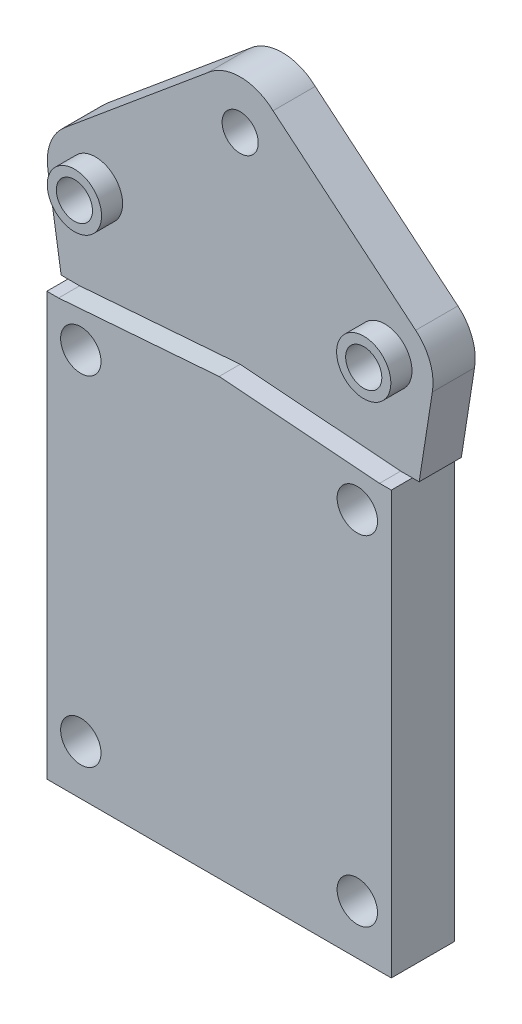
ISO-10303-21;
HEADER;
FILE_DESCRIPTION(('STEP AP214'),'2;1');
FILE_NAME('part.step','',(''),(''),'','','');
FILE_SCHEMA(('AUTOMOTIVE_DESIGN { 1 0 10303 214 1 1 1 1 }'));
ENDSEC;
DATA;
#1=APPLICATION_CONTEXT('core data for automotive mechanical design processes');
#2=APPLICATION_PROTOCOL_DEFINITION('international standard','automotive_design',2000,#1);
#3=PRODUCT_CONTEXT('',#1,'mechanical');
#4=PRODUCT('Part','Part','',(#3));
#5=PRODUCT_RELATED_PRODUCT_CATEGORY('part','',(#4));
#6=PRODUCT_DEFINITION_FORMATION('','',#4);
#7=PRODUCT_DEFINITION_CONTEXT('part definition',#1,'design');
#8=PRODUCT_DEFINITION('design','',#6,#7);
#9=PRODUCT_DEFINITION_SHAPE('','',#8);
#10=(LENGTH_UNIT() NAMED_UNIT(*) SI_UNIT(.MILLI.,.METRE.));
#11=(NAMED_UNIT(*) PLANE_ANGLE_UNIT() SI_UNIT($,.RADIAN.));
#12=(NAMED_UNIT(*) SI_UNIT($,.STERADIAN.) SOLID_ANGLE_UNIT());
#13=UNCERTAINTY_MEASURE_WITH_UNIT(LENGTH_MEASURE(1.E-05),#10,'distance_accuracy_value','');
#14=(GEOMETRIC_REPRESENTATION_CONTEXT(3) GLOBAL_UNCERTAINTY_ASSIGNED_CONTEXT((#13)) GLOBAL_UNIT_ASSIGNED_CONTEXT((#10,
#11,#12)) REPRESENTATION_CONTEXT('',''));
#15=CARTESIAN_POINT('',(0.,0.,0.));
#16=DIRECTION('',(0.,0.,1.));
#17=DIRECTION('',(1.,0.,0.));
#18=AXIS2_PLACEMENT_3D('',#15,#16,#17);
#19=CARTESIAN_POINT('',(0.,5.99999999999987,5.25));
#20=DIRECTION('',(0.,0.,1.));
#21=DIRECTION('',(1.,0.,0.));
#22=AXIS2_PLACEMENT_3D('',#19,#20,#21);
#23=PLANE('',#22);
#24=CARTESIAN_POINT('',(11.4681,-26.6067522619701,5.25));
#25=DIRECTION('',(0.,0.,1.));
#26=DIRECTION('',(1.,0.,0.));
#27=AXIS2_PLACEMENT_3D('',#24,#25,#26);
#28=CIRCLE('',#27,1.6764);
#29=CARTESIAN_POINT('',(13.1445,-26.6067522619701,5.25));
#30=VERTEX_POINT('',#29);
#31=EDGE_CURVE('E571',#30,#30,#28,.F.);
#32=ORIENTED_EDGE('',*,*,#31,.T.);
#33=EDGE_LOOP('',(#32));
#34=FACE_BOUND('',#33,.T.);
#35=CARTESIAN_POINT('',(11.4681,1.51104773802989,5.25));
#36=DIRECTION('',(0.,0.,1.));
#37=DIRECTION('',(1.,0.,0.));
#38=AXIS2_PLACEMENT_3D('',#35,#36,#37);
#39=CIRCLE('',#38,1.6764);
#40=CARTESIAN_POINT('',(13.1445,1.51104773802989,5.25));
#41=VERTEX_POINT('',#40);
#42=EDGE_CURVE('E390',#41,#41,#39,.T.);
#43=ORIENTED_EDGE('',*,*,#42,.F.);
#44=EDGE_LOOP('',(#43));
#45=FACE_BOUND('',#44,.T.);
#46=DIRECTION('',(0.99708052716181,0.0763572023762474,0.));
#47=VECTOR('',#46,1.);
#48=CARTESIAN_POINT('',(-6.6567113199423,4.84022386901494,5.25));
#49=LINE('',#48,#47);
#50=CARTESIAN_POINT('',(-13.3134226398846,4.33044773802989,5.25));
#51=VERTEX_POINT('',#50);
#52=CARTESIAN_POINT('',(0.,5.35,5.25));
#53=VERTEX_POINT('',#52);
#54=EDGE_CURVE('E261',#51,#53,#49,.T.);
#55=ORIENTED_EDGE('',*,*,#54,.F.);
#56=DIRECTION('',(-1.,0.,0.));
#57=VECTOR('',#56,1.);
#58=CARTESIAN_POINT('',(-14.2875,4.33044773802989,5.25));
#59=LINE('',#58,#57);
#60=CARTESIAN_POINT('',(-14.2875,4.33044773802989,5.25));
#61=VERTEX_POINT('',#60);
#62=EDGE_CURVE('E400',#51,#61,#59,.T.);
#63=ORIENTED_EDGE('',*,*,#62,.T.);
#64=DIRECTION('',(0.,1.,0.));
#65=VECTOR('',#64,1.);
#66=CARTESIAN_POINT('',(-14.2875,-30.7215522619701,5.25));
#67=LINE('',#66,#65);
#68=CARTESIAN_POINT('',(-14.2875,-30.7215522619701,5.25));
#69=VERTEX_POINT('',#68);
#70=EDGE_CURVE('E219',#69,#61,#67,.T.);
#71=ORIENTED_EDGE('',*,*,#70,.F.);
#72=DIRECTION('',(-1.,0.,0.));
#73=VECTOR('',#72,1.);
#74=CARTESIAN_POINT('',(-14.2875,-30.7215522619701,5.25));
#75=LINE('',#74,#73);
#76=CARTESIAN_POINT('',(14.2875,-30.7215522619701,5.25));
#77=VERTEX_POINT('',#76);
#78=EDGE_CURVE('E212',#77,#69,#75,.T.);
#79=ORIENTED_EDGE('',*,*,#78,.F.);
#80=DIRECTION('',(0.,1.,0.));
#81=VECTOR('',#80,1.);
#82=CARTESIAN_POINT('',(14.2875,-30.7215522619701,5.25));
#83=LINE('',#82,#81);
#84=CARTESIAN_POINT('',(14.2875,4.33044773802989,5.25));
#85=VERTEX_POINT('',#84);
#86=EDGE_CURVE('E217',#77,#85,#83,.T.);
#87=ORIENTED_EDGE('',*,*,#86,.T.);
#88=CARTESIAN_POINT('',(13.3134226398846,4.33044773802989,5.25));
#89=VERTEX_POINT('',#88);
#90=EDGE_CURVE('E404',#85,#89,#59,.T.);
#91=ORIENTED_EDGE('',*,*,#90,.T.);
#92=DIRECTION('',(-0.99708052716181,0.0763572023762474,0.));
#93=VECTOR('',#92,1.);
#94=CARTESIAN_POINT('',(6.6567113199423,4.84022386901494,5.25));
#95=LINE('',#94,#93);
#96=EDGE_CURVE('E257',#89,#53,#95,.T.);
#97=ORIENTED_EDGE('',*,*,#96,.T.);
#98=EDGE_LOOP('',(#55,#63,#71,#79,#87,#91,#97));
#99=FACE_BOUND('',#98,.T.);
#100=CARTESIAN_POINT('',(-11.4681,-26.6067522619701,5.25));
#101=DIRECTION('',(0.,0.,1.));
#102=DIRECTION('',(1.,0.,0.));
#103=AXIS2_PLACEMENT_3D('',#100,#101,#102);
#104=CIRCLE('',#103,1.6764);
#105=CARTESIAN_POINT('',(-9.79170000000002,-26.6067522619701,5.25));
#106=VERTEX_POINT('',#105);
#107=EDGE_CURVE('E574',#106,#106,#104,.T.);
#108=ORIENTED_EDGE('',*,*,#107,.F.);
#109=EDGE_LOOP('',(#108));
#110=FACE_BOUND('',#109,.T.);
#111=CARTESIAN_POINT('',(-11.4681,1.51104773802989,5.25));
#112=DIRECTION('',(0.,0.,1.));
#113=DIRECTION('',(1.,0.,0.));
#114=AXIS2_PLACEMENT_3D('',#111,#112,#113);
#115=CIRCLE('',#114,1.6764);
#116=CARTESIAN_POINT('',(-9.79170000000002,1.51104773802989,5.25));
#117=VERTEX_POINT('',#116);
#118=EDGE_CURVE('E579',#117,#117,#115,.F.);
#119=ORIENTED_EDGE('',*,*,#118,.T.);
#120=EDGE_LOOP('',(#119));
#121=FACE_BOUND('',#120,.T.);
#122=ADVANCED_FACE('F39',(#34,#45,#99,#110,#121),#23,.T.);
#123=CARTESIAN_POINT('',(0.,6.,0.));
#124=DIRECTION('',(0.,0.,1.));
#125=DIRECTION('',(1.,0.,0.));
#126=AXIS2_PLACEMENT_3D('',#123,#124,#125);
#127=PLANE('',#126);
#128=CARTESIAN_POINT('',(-11.4681,-26.6067522619701,0.));
#129=DIRECTION('',(0.,0.,1.));
#130=DIRECTION('',(1.,0.,0.));
#131=AXIS2_PLACEMENT_3D('',#128,#129,#130);
#132=CIRCLE('',#131,1.6764);
#133=CARTESIAN_POINT('',(-9.79170000000002,-26.6067522619701,0.));
#134=VERTEX_POINT('',#133);
#135=EDGE_CURVE('E392',#134,#134,#132,.T.);
#136=ORIENTED_EDGE('',*,*,#135,.T.);
#137=EDGE_LOOP('',(#136));
#138=FACE_BOUND('',#137,.T.);
#139=CARTESIAN_POINT('',(11.4681,1.51104773802989,0.));
#140=DIRECTION('',(0.,0.,1.));
#141=DIRECTION('',(1.,0.,0.));
#142=AXIS2_PLACEMENT_3D('',#139,#140,#141);
#143=CIRCLE('',#142,1.6764);
#144=CARTESIAN_POINT('',(13.1445,1.51104773802989,0.));
#145=VERTEX_POINT('',#144);
#146=EDGE_CURVE('E386',#145,#145,#143,.T.);
#147=ORIENTED_EDGE('',*,*,#146,.T.);
#148=EDGE_LOOP('',(#147));
#149=FACE_BOUND('',#148,.T.);
#150=CARTESIAN_POINT('',(0.,22.,0.));
#151=DIRECTION('',(0.,0.,1.));
#152=DIRECTION('',(1.,0.,0.));
#153=AXIS2_PLACEMENT_3D('',#150,#151,#152);
#154=CIRCLE('',#153,1.5);
#155=CARTESIAN_POINT('',(1.5,22.,0.));
#156=VERTEX_POINT('',#155);
#157=EDGE_CURVE('E289',#156,#156,#154,.T.);
#158=ORIENTED_EDGE('',*,*,#157,.T.);
#159=EDGE_LOOP('',(#158));
#160=FACE_BOUND('',#159,.T.);
#161=CARTESIAN_POINT('',(12.,12.,0.));
#162=DIRECTION('',(0.,0.,1.));
#163=DIRECTION('',(1.,0.,0.));
#164=AXIS2_PLACEMENT_3D('',#161,#162,#163);
#165=CIRCLE('',#164,1.5);
#166=CARTESIAN_POINT('',(13.5,12.,0.));
#167=VERTEX_POINT('',#166);
#168=EDGE_CURVE('E292',#167,#167,#165,.T.);
#169=ORIENTED_EDGE('',*,*,#168,.T.);
#170=EDGE_LOOP('',(#169));
#171=FACE_BOUND('',#170,.T.);
#172=CARTESIAN_POINT('',(-12.,12.,0.));
#173=DIRECTION('',(0.,0.,1.));
#174=DIRECTION('',(1.,0.,0.));
#175=AXIS2_PLACEMENT_3D('',#172,#173,#174);
#176=CIRCLE('',#175,1.5);
#177=CARTESIAN_POINT('',(-10.5,12.,0.));
#178=VERTEX_POINT('',#177);
#179=EDGE_CURVE('E313',#178,#178,#176,.T.);
#180=ORIENTED_EDGE('',*,*,#179,.T.);
#181=EDGE_LOOP('',(#180));
#182=FACE_BOUND('',#181,.T.);
#183=DIRECTION('',(1.,0.,0.));
#184=VECTOR('',#183,1.);
#185=CARTESIAN_POINT('',(0.,4.33044773802989,0.));
#186=LINE('',#185,#184);
#187=CARTESIAN_POINT('',(-14.8480493678358,4.33044773802989,0.));
#188=VERTEX_POINT('',#187);
#189=CARTESIAN_POINT('',(-14.2875,4.33044773802989,0.));
#190=VERTEX_POINT('',#189);
#191=EDGE_CURVE('E239',#188,#190,#186,.T.);
#192=ORIENTED_EDGE('',*,*,#191,.F.);
#193=DIRECTION('',(0.154606944775899,-0.98797605873172,0.));
#194=VECTOR('',#193,1.);
#195=CARTESIAN_POINT('',(-14.8870419181073,4.57961963773293,0.));
#196=LINE('',#195,#194);
#197=CARTESIAN_POINT('',(-15.9424190139707,11.3237365023286,0.));
#198=VERTEX_POINT('',#197);
#199=EDGE_CURVE('E358',#198,#188,#196,.T.);
#200=ORIENTED_EDGE('',*,*,#199,.F.);
#201=CARTESIAN_POINT('',(-12.,12.,0.));
#202=DIRECTION('',(0.,0.,1.));
#203=DIRECTION('',(1.,0.,0.));
#204=AXIS2_PLACEMENT_3D('',#201,#202,#203);
#205=CIRCLE('',#204,4.);
#206=CARTESIAN_POINT('',(-14.5595064902129,15.0739106243607,0.));
#207=VERTEX_POINT('',#206);
#208=EDGE_CURVE('E349',#207,#198,#205,.T.);
#209=ORIENTED_EDGE('',*,*,#208,.F.);
#210=DIRECTION('',(-0.768477656090189,-0.63987662255323,0.));
#211=VECTOR('',#210,1.);
#212=CARTESIAN_POINT('',(-8.64343811656622,19.9999534568654,0.));
#213=LINE('',#212,#211);
#214=CARTESIAN_POINT('',(-2.72736974291952,24.92599628937,0.));
#215=VERTEX_POINT('',#214);
#216=EDGE_CURVE('E311',#215,#207,#213,.T.);
#217=ORIENTED_EDGE('',*,*,#216,.F.);
#218=CARTESIAN_POINT('',(6.90636783873266E-13,22.0000000000008,0.));
#219=DIRECTION('',(0.,0.,1.));
#220=DIRECTION('',(1.,0.,0.));
#221=AXIS2_PLACEMENT_3D('',#218,#219,#220);
#222=CIRCLE('',#221,3.99999999999893);
#223=CARTESIAN_POINT('',(2.72736974291952,24.92599628937,0.));
#224=VERTEX_POINT('',#223);
#225=EDGE_CURVE('E267',#224,#215,#222,.T.);
#226=ORIENTED_EDGE('',*,*,#225,.F.);
#227=DIRECTION('',(0.768477656090189,-0.63987662255323,0.));
#228=VECTOR('',#227,1.);
#229=CARTESIAN_POINT('',(8.64343811656622,19.9999534568654,0.));
#230=LINE('',#229,#228);
#231=CARTESIAN_POINT('',(14.5595064902129,15.0739106243607,0.));
#232=VERTEX_POINT('',#231);
#233=EDGE_CURVE('E293',#224,#232,#230,.T.);
#234=ORIENTED_EDGE('',*,*,#233,.T.);
#235=CARTESIAN_POINT('',(12.,12.,0.));
#236=DIRECTION('',(0.,0.,-1.));
#237=DIRECTION('',(1.,0.,0.));
#238=AXIS2_PLACEMENT_3D('',#235,#236,#237);
#239=CIRCLE('',#238,4.);
#240=CARTESIAN_POINT('',(15.9424190139707,11.3237365023286,0.));
#241=VERTEX_POINT('',#240);
#242=EDGE_CURVE('E284',#232,#241,#239,.T.);
#243=ORIENTED_EDGE('',*,*,#242,.T.);
#244=DIRECTION('',(-0.154606944775899,-0.98797605873172,0.));
#245=VECTOR('',#244,1.);
#246=CARTESIAN_POINT('',(14.8870419181073,4.57961963773293,0.));
#247=LINE('',#246,#245);
#248=CARTESIAN_POINT('',(14.8480493678358,4.33044773802989,0.));
#249=VERTEX_POINT('',#248);
#250=EDGE_CURVE('E282',#241,#249,#247,.T.);
#251=ORIENTED_EDGE('',*,*,#250,.T.);
#252=CARTESIAN_POINT('',(14.2875,4.33044773802989,0.));
#253=VERTEX_POINT('',#252);
#254=EDGE_CURVE('E237',#253,#249,#186,.T.);
#255=ORIENTED_EDGE('',*,*,#254,.F.);
#256=DIRECTION('',(0.,1.,0.));
#257=VECTOR('',#256,1.);
#258=CARTESIAN_POINT('',(14.2875,-30.7215522619701,0.));
#259=LINE('',#258,#257);
#260=CARTESIAN_POINT('',(14.2875,-30.7215522619701,0.));
#261=VERTEX_POINT('',#260);
#262=EDGE_CURVE('E407',#261,#253,#259,.T.);
#263=ORIENTED_EDGE('',*,*,#262,.F.);
#264=DIRECTION('',(1.,0.,0.));
#265=VECTOR('',#264,1.);
#266=CARTESIAN_POINT('',(-14.2875,-30.7215522619701,0.));
#267=LINE('',#266,#265);
#268=CARTESIAN_POINT('',(-14.2875,-30.7215522619701,0.));
#269=VERTEX_POINT('',#268);
#270=EDGE_CURVE('E228',#269,#261,#267,.T.);
#271=ORIENTED_EDGE('',*,*,#270,.F.);
#272=DIRECTION('',(0.,1.,0.));
#273=VECTOR('',#272,1.);
#274=CARTESIAN_POINT('',(-14.2875,-30.7215522619701,0.));
#275=LINE('',#274,#273);
#276=EDGE_CURVE('E241',#269,#190,#275,.T.);
#277=ORIENTED_EDGE('',*,*,#276,.T.);
#278=EDGE_LOOP('',(#192,#200,#209,#217,#226,#234,#243,#251,#255,#263,#271,#277));
#279=FACE_BOUND('',#278,.T.);
#280=CARTESIAN_POINT('',(11.4681,-26.6067522619701,0.));
#281=DIRECTION('',(0.,0.,1.));
#282=DIRECTION('',(1.,0.,0.));
#283=AXIS2_PLACEMENT_3D('',#280,#281,#282);
#284=CIRCLE('',#283,1.6764);
#285=CARTESIAN_POINT('',(13.1445,-26.6067522619701,0.));
#286=VERTEX_POINT('',#285);
#287=EDGE_CURVE('E389',#286,#286,#284,.F.);
#288=ORIENTED_EDGE('',*,*,#287,.F.);
#289=EDGE_LOOP('',(#288));
#290=FACE_BOUND('',#289,.T.);
#291=CARTESIAN_POINT('',(-11.4681,1.51104773802989,0.));
#292=DIRECTION('',(0.,0.,1.));
#293=DIRECTION('',(1.,0.,0.));
#294=AXIS2_PLACEMENT_3D('',#291,#292,#293);
#295=CIRCLE('',#294,1.6764);
#296=CARTESIAN_POINT('',(-9.79170000000002,1.51104773802989,0.));
#297=VERTEX_POINT('',#296);
#298=EDGE_CURVE('E43',#297,#297,#295,.F.);
#299=ORIENTED_EDGE('',*,*,#298,.F.);
#300=EDGE_LOOP('',(#299));
#301=FACE_BOUND('',#300,.T.);
#302=ADVANCED_FACE('F41',(#138,#149,#160,#171,#182,#279,#290,#301),#127,.F.);
#303=CARTESIAN_POINT('',(0.,4.33044773802989,0.));
#304=DIRECTION('',(0.,-1.,0.));
#305=DIRECTION('',(0.,0.,-1.));
#306=AXIS2_PLACEMENT_3D('',#303,#304,#305);
#307=PLANE('',#306);
#308=DIRECTION('',(0.,0.,1.));
#309=VECTOR('',#308,1.);
#310=CARTESIAN_POINT('',(14.2875,4.33044773802989,5.25));
#311=LINE('',#310,#309);
#312=CARTESIAN_POINT('',(14.2875,4.33044773802989,3.5));
#313=VERTEX_POINT('',#312);
#314=EDGE_CURVE('E62',#253,#313,#311,.T.);
#315=ORIENTED_EDGE('',*,*,#314,.F.);
#316=ORIENTED_EDGE('',*,*,#254,.T.);
#317=DIRECTION('',(0.,0.,-1.));
#318=VECTOR('',#317,1.);
#319=CARTESIAN_POINT('',(14.8480493678358,4.33044773802989,3.5));
#320=LINE('',#319,#318);
#321=CARTESIAN_POINT('',(14.8480493678358,4.33044773802989,3.5));
#322=VERTEX_POINT('',#321);
#323=EDGE_CURVE('E245',#322,#249,#320,.T.);
#324=ORIENTED_EDGE('',*,*,#323,.F.);
#325=DIRECTION('',(1.,0.,0.));
#326=VECTOR('',#325,1.);
#327=CARTESIAN_POINT('',(0.,4.33044773802989,3.5));
#328=LINE('',#327,#326);
#329=EDGE_CURVE('E57',#313,#322,#328,.T.);
#330=ORIENTED_EDGE('',*,*,#329,.F.);
#331=EDGE_LOOP('',(#315,#316,#324,#330));
#332=FACE_BOUND('',#331,.T.);
#333=ADVANCED_FACE('F433',(#332),#307,.T.);
#334=CARTESIAN_POINT('',(14.8870419181073,4.57961963773293,3.5));
#335=DIRECTION('',(0.98797605873172,-0.154606944775899,0.));
#336=DIRECTION('',(0.,0.,-1.));
#337=AXIS2_PLACEMENT_3D('',#334,#335,#336);
#338=PLANE('',#337);
#339=DIRECTION('',(-0.154606944775899,-0.98797605873172,0.));
#340=VECTOR('',#339,1.);
#341=CARTESIAN_POINT('',(14.8870419181073,4.57961963773293,3.5));
#342=LINE('',#341,#340);
#343=CARTESIAN_POINT('',(15.9424190139707,11.3237365023286,3.5));
#344=VERTEX_POINT('',#343);
#345=EDGE_CURVE('E256',#344,#322,#342,.T.);
#346=ORIENTED_EDGE('',*,*,#345,.T.);
#347=ORIENTED_EDGE('',*,*,#323,.T.);
#348=ORIENTED_EDGE('',*,*,#250,.F.);
#349=DIRECTION('',(0.,0.,-1.));
#350=VECTOR('',#349,1.);
#351=CARTESIAN_POINT('',(15.9424190139707,11.3237365023286,3.5));
#352=LINE('',#351,#350);
#353=EDGE_CURVE('E288',#344,#241,#352,.T.);
#354=ORIENTED_EDGE('',*,*,#353,.F.);
#355=EDGE_LOOP('',(#346,#347,#348,#354));
#356=FACE_BOUND('',#355,.T.);
#357=ADVANCED_FACE('F436',(#356),#338,.T.);
#358=CARTESIAN_POINT('',(-14.8870419181073,4.57961963773293,3.5));
#359=DIRECTION('',(0.98797605873172,0.154606944775899,0.));
#360=DIRECTION('',(0.,0.,-1.));
#361=AXIS2_PLACEMENT_3D('',#358,#359,#360);
#362=PLANE('',#361);
#363=DIRECTION('',(0.,0.,-1.));
#364=VECTOR('',#363,1.);
#365=CARTESIAN_POINT('',(-14.8480493678358,4.33044773802989,3.5));
#366=LINE('',#365,#364);
#367=CARTESIAN_POINT('',(-14.8480493678358,4.33044773802989,3.5));
#368=VERTEX_POINT('',#367);
#369=EDGE_CURVE('E248',#368,#188,#366,.T.);
#370=ORIENTED_EDGE('',*,*,#369,.F.);
#371=DIRECTION('',(0.154606944775899,-0.98797605873172,0.));
#372=VECTOR('',#371,1.);
#373=CARTESIAN_POINT('',(-14.8870419181073,4.57961963773293,3.5));
#374=LINE('',#373,#372);
#375=CARTESIAN_POINT('',(-15.9424190139707,11.3237365023286,3.5));
#376=VERTEX_POINT('',#375);
#377=EDGE_CURVE('E268',#376,#368,#374,.T.);
#378=ORIENTED_EDGE('',*,*,#377,.F.);
#379=DIRECTION('',(0.,0.,-1.));
#380=VECTOR('',#379,1.);
#381=CARTESIAN_POINT('',(-15.9424190139707,11.3237365023286,3.5));
#382=LINE('',#381,#380);
#383=EDGE_CURVE('E353',#376,#198,#382,.T.);
#384=ORIENTED_EDGE('',*,*,#383,.T.);
#385=ORIENTED_EDGE('',*,*,#199,.T.);
#386=EDGE_LOOP('',(#370,#378,#384,#385));
#387=FACE_BOUND('',#386,.T.);
#388=ADVANCED_FACE('F454',(#387),#362,.F.);
#389=CARTESIAN_POINT('',(0.,6.,3.5));
#390=DIRECTION('',(0.,0.,1.));
#391=DIRECTION('',(1.,0.,0.));
#392=AXIS2_PLACEMENT_3D('',#389,#390,#391);
#393=PLANE('',#392);
#394=CARTESIAN_POINT('',(-12.,12.,3.5));
#395=DIRECTION('',(0.,0.,1.));
#396=DIRECTION('',(1.,0.,0.));
#397=AXIS2_PLACEMENT_3D('',#394,#395,#396);
#398=CIRCLE('',#397,2.25);
#399=CARTESIAN_POINT('',(-9.75,12.,3.5));
#400=VERTEX_POINT('',#399);
#401=EDGE_CURVE('E294',#400,#400,#398,.T.);
#402=ORIENTED_EDGE('',*,*,#401,.F.);
#403=EDGE_LOOP('',(#402));
#404=FACE_BOUND('',#403,.T.);
#405=CARTESIAN_POINT('',(12.,12.,3.5));
#406=DIRECTION('',(0.,0.,1.));
#407=DIRECTION('',(1.,0.,0.));
#408=AXIS2_PLACEMENT_3D('',#405,#406,#407);
#409=CIRCLE('',#408,2.25);
#410=CARTESIAN_POINT('',(14.25,12.,3.5));
#411=VERTEX_POINT('',#410);
#412=EDGE_CURVE('E297',#411,#411,#409,.T.);
#413=ORIENTED_EDGE('',*,*,#412,.F.);
#414=EDGE_LOOP('',(#413));
#415=FACE_BOUND('',#414,.T.);
#416=CARTESIAN_POINT('',(0.,22.,3.5));
#417=DIRECTION('',(0.,0.,-1.));
#418=DIRECTION('',(1.,0.,0.));
#419=AXIS2_PLACEMENT_3D('',#416,#417,#418);
#420=CIRCLE('',#419,1.5);
#421=CARTESIAN_POINT('',(1.5,22.,3.5));
#422=VERTEX_POINT('',#421);
#423=EDGE_CURVE('E250',#422,#422,#420,.T.);
#424=ORIENTED_EDGE('',*,*,#423,.T.);
#425=EDGE_LOOP('',(#424));
#426=FACE_BOUND('',#425,.T.);
#427=ORIENTED_EDGE('',*,*,#377,.T.);
#428=CARTESIAN_POINT('',(-14.2875,4.33044773802989,3.5));
#429=VERTEX_POINT('',#428);
#430=EDGE_CURVE('E48',#368,#429,#328,.T.);
#431=ORIENTED_EDGE('',*,*,#430,.T.);
#432=CARTESIAN_POINT('',(-13.3134226398845,4.33044773802989,3.5));
#433=VERTEX_POINT('',#432);
#434=EDGE_CURVE('E385',#429,#433,#328,.T.);
#435=ORIENTED_EDGE('',*,*,#434,.T.);
#436=DIRECTION('',(0.99708052716181,0.0763572023762474,0.));
#437=VECTOR('',#436,1.);
#438=CARTESIAN_POINT('',(-6.6567113199423,4.84022386901494,3.5));
#439=LINE('',#438,#437);
#440=CARTESIAN_POINT('',(0.,5.35,3.5));
#441=VERTEX_POINT('',#440);
#442=EDGE_CURVE('E263',#433,#441,#439,.T.);
#443=ORIENTED_EDGE('',*,*,#442,.T.);
#444=DIRECTION('',(-0.99708052716181,0.0763572023762474,0.));
#445=VECTOR('',#444,1.);
#446=CARTESIAN_POINT('',(6.6567113199423,4.84022386901494,3.5));
#447=LINE('',#446,#445);
#448=CARTESIAN_POINT('',(13.3134226398845,4.33044773802989,3.5));
#449=VERTEX_POINT('',#448);
#450=EDGE_CURVE('E277',#449,#441,#447,.T.);
#451=ORIENTED_EDGE('',*,*,#450,.F.);
#452=EDGE_CURVE('E383',#449,#313,#328,.T.);
#453=ORIENTED_EDGE('',*,*,#452,.T.);
#454=ORIENTED_EDGE('',*,*,#329,.T.);
#455=ORIENTED_EDGE('',*,*,#345,.F.);
#456=CARTESIAN_POINT('',(12.,12.,3.5));
#457=DIRECTION('',(0.,0.,-1.));
#458=DIRECTION('',(1.,0.,0.));
#459=AXIS2_PLACEMENT_3D('',#456,#457,#458);
#460=CIRCLE('',#459,4.);
#461=CARTESIAN_POINT('',(14.5595064902129,15.0739106243607,3.5));
#462=VERTEX_POINT('',#461);
#463=EDGE_CURVE('E251',#462,#344,#460,.T.);
#464=ORIENTED_EDGE('',*,*,#463,.F.);
#465=DIRECTION('',(0.768477656090189,-0.63987662255323,0.));
#466=VECTOR('',#465,1.);
#467=CARTESIAN_POINT('',(8.64343811656622,19.9999534568654,3.5));
#468=LINE('',#467,#466);
#469=CARTESIAN_POINT('',(2.72736974291952,24.92599628937,3.5));
#470=VERTEX_POINT('',#469);
#471=EDGE_CURVE('E255',#470,#462,#468,.T.);
#472=ORIENTED_EDGE('',*,*,#471,.F.);
#473=CARTESIAN_POINT('',(6.90636783873266E-13,22.0000000000008,3.5));
#474=DIRECTION('',(0.,0.,1.));
#475=DIRECTION('',(1.,0.,0.));
#476=AXIS2_PLACEMENT_3D('',#473,#474,#475);
#477=CIRCLE('',#476,3.99999999999893);
#478=CARTESIAN_POINT('',(-2.72736974291952,24.92599628937,3.5));
#479=VERTEX_POINT('',#478);
#480=EDGE_CURVE('E269',#470,#479,#477,.T.);
#481=ORIENTED_EDGE('',*,*,#480,.T.);
#482=DIRECTION('',(-0.768477656090189,-0.63987662255323,0.));
#483=VECTOR('',#482,1.);
#484=CARTESIAN_POINT('',(-8.64343811656622,19.9999534568654,3.5));
#485=LINE('',#484,#483);
#486=CARTESIAN_POINT('',(-14.5595064902129,15.0739106243607,3.5));
#487=VERTEX_POINT('',#486);
#488=EDGE_CURVE('E273',#479,#487,#485,.T.);
#489=ORIENTED_EDGE('',*,*,#488,.T.);
#490=CARTESIAN_POINT('',(-12.,12.,3.5));
#491=DIRECTION('',(0.,0.,1.));
#492=DIRECTION('',(1.,0.,0.));
#493=AXIS2_PLACEMENT_3D('',#490,#491,#492);
#494=CIRCLE('',#493,4.);
#495=EDGE_CURVE('E327',#487,#376,#494,.T.);
#496=ORIENTED_EDGE('',*,*,#495,.T.);
#497=EDGE_LOOP('',(#427,#431,#435,#443,#451,#453,#454,#455,#464,#472,#481,#489,#496));
#498=FACE_BOUND('',#497,.T.);
#499=ADVANCED_FACE('F422',(#404,#415,#426,#498),#393,.T.);
#500=CARTESIAN_POINT('',(-6.6567113199423,4.84022386901494,5.25));
#501=DIRECTION('',(-0.0763572023762474,0.99708052716181,0.));
#502=DIRECTION('',(0.,0.,1.));
#503=AXIS2_PLACEMENT_3D('',#500,#501,#502);
#504=PLANE('',#503);
#505=ORIENTED_EDGE('',*,*,#442,.F.);
#506=DIRECTION('',(0.,0.,-1.));
#507=VECTOR('',#506,1.);
#508=CARTESIAN_POINT('',(-13.3134226398846,4.33044773802988,5.25));
#509=LINE('',#508,#507);
#510=EDGE_CURVE('E278',#51,#433,#509,.T.);
#511=ORIENTED_EDGE('',*,*,#510,.F.);
#512=ORIENTED_EDGE('',*,*,#54,.T.);
#513=DIRECTION('',(0.,0.,-1.));
#514=VECTOR('',#513,1.);
#515=CARTESIAN_POINT('',(0.,5.35,5.25));
#516=LINE('',#515,#514);
#517=EDGE_CURVE('E262',#53,#441,#516,.T.);
#518=ORIENTED_EDGE('',*,*,#517,.T.);
#519=EDGE_LOOP('',(#505,#511,#512,#518));
#520=FACE_BOUND('',#519,.T.);
#521=ADVANCED_FACE('F461',(#520),#504,.T.);
#522=CARTESIAN_POINT('',(6.6567113199423,4.84022386901494,5.25));
#523=DIRECTION('',(-0.0763572023762474,-0.99708052716181,0.));
#524=DIRECTION('',(-0.99708052716181,0.0763572023762474,0.));
#525=AXIS2_PLACEMENT_3D('',#522,#523,#524);
#526=PLANE('',#525);
#527=ORIENTED_EDGE('',*,*,#450,.T.);
#528=ORIENTED_EDGE('',*,*,#517,.F.);
#529=ORIENTED_EDGE('',*,*,#96,.F.);
#530=DIRECTION('',(0.,0.,-1.));
#531=VECTOR('',#530,1.);
#532=CARTESIAN_POINT('',(13.3134226398846,4.33044773802988,5.25));
#533=LINE('',#532,#531);
#534=EDGE_CURVE('E283',#89,#449,#533,.T.);
#535=ORIENTED_EDGE('',*,*,#534,.T.);
#536=EDGE_LOOP('',(#527,#528,#529,#535));
#537=FACE_BOUND('',#536,.T.);
#538=ADVANCED_FACE('F520',(#537),#526,.F.);
#539=CARTESIAN_POINT('',(0.,5.99999999999987,5.25));
#540=DIRECTION('',(0.,0.,1.));
#541=DIRECTION('',(1.,0.,0.));
#542=AXIS2_PLACEMENT_3D('',#539,#540,#541);
#543=PLANE('',#542);
#544=CARTESIAN_POINT('',(-12.,12.,5.25));
#545=DIRECTION('',(0.,0.,1.));
#546=DIRECTION('',(1.,0.,0.));
#547=AXIS2_PLACEMENT_3D('',#544,#545,#546);
#548=CIRCLE('',#547,2.25);
#549=CARTESIAN_POINT('',(-9.75,12.,5.25));
#550=VERTEX_POINT('',#549);
#551=EDGE_CURVE('E298',#550,#550,#548,.T.);
#552=ORIENTED_EDGE('',*,*,#551,.T.);
#553=EDGE_LOOP('',(#552));
#554=FACE_BOUND('',#553,.T.);
#555=CARTESIAN_POINT('',(-12.,12.,5.25));
#556=DIRECTION('',(0.,0.,-1.));
#557=DIRECTION('',(1.,0.,0.));
#558=AXIS2_PLACEMENT_3D('',#555,#556,#557);
#559=CIRCLE('',#558,1.5);
#560=CARTESIAN_POINT('',(-10.5,12.,5.25));
#561=VERTEX_POINT('',#560);
#562=EDGE_CURVE('E316',#561,#561,#559,.T.);
#563=ORIENTED_EDGE('',*,*,#562,.T.);
#564=EDGE_LOOP('',(#563));
#565=FACE_BOUND('',#564,.T.);
#566=ADVANCED_FACE('F496',(#554,#565),#543,.T.);
#567=CARTESIAN_POINT('',(-12.,12.,5.25));
#568=DIRECTION('',(0.,0.,-1.));
#569=DIRECTION('',(-1.,0.,0.));
#570=AXIS2_PLACEMENT_3D('',#567,#568,#569);
#571=CYLINDRICAL_SURFACE('',#570,2.25);
#572=ORIENTED_EDGE('',*,*,#401,.T.);
#573=EDGE_LOOP('',(#572));
#574=FACE_BOUND('',#573,.T.);
#575=ORIENTED_EDGE('',*,*,#551,.F.);
#576=EDGE_LOOP('',(#575));
#577=FACE_BOUND('',#576,.T.);
#578=ADVANCED_FACE('F488',(#574,#577),#571,.T.);
#579=CARTESIAN_POINT('',(0.,5.99999999999987,5.25));
#580=DIRECTION('',(0.,0.,1.));
#581=DIRECTION('',(1.,0.,0.));
#582=AXIS2_PLACEMENT_3D('',#579,#580,#581);
#583=PLANE('',#582);
#584=CARTESIAN_POINT('',(12.,12.,5.25));
#585=DIRECTION('',(0.,0.,1.));
#586=DIRECTION('',(1.,0.,0.));
#587=AXIS2_PLACEMENT_3D('',#584,#585,#586);
#588=CIRCLE('',#587,2.25);
#589=CARTESIAN_POINT('',(14.25,12.,5.25));
#590=VERTEX_POINT('',#589);
#591=EDGE_CURVE('E301',#590,#590,#588,.T.);
#592=ORIENTED_EDGE('',*,*,#591,.T.);
#593=EDGE_LOOP('',(#592));
#594=FACE_BOUND('',#593,.T.);
#595=CARTESIAN_POINT('',(12.,12.,5.25));
#596=DIRECTION('',(0.,0.,-1.));
#597=DIRECTION('',(1.,0.,0.));
#598=AXIS2_PLACEMENT_3D('',#595,#596,#597);
#599=CIRCLE('',#598,1.5);
#600=CARTESIAN_POINT('',(13.5,12.,5.25));
#601=VERTEX_POINT('',#600);
#602=EDGE_CURVE('E333',#601,#601,#599,.T.);
#603=ORIENTED_EDGE('',*,*,#602,.T.);
#604=EDGE_LOOP('',(#603));
#605=FACE_BOUND('',#604,.T.);
#606=ADVANCED_FACE('F485',(#594,#605),#583,.T.);
#607=CARTESIAN_POINT('',(12.,12.,5.25));
#608=DIRECTION('',(0.,0.,-1.));
#609=DIRECTION('',(-1.,0.,0.));
#610=AXIS2_PLACEMENT_3D('',#607,#608,#609);
#611=CYLINDRICAL_SURFACE('',#610,2.25);
#612=ORIENTED_EDGE('',*,*,#412,.T.);
#613=EDGE_LOOP('',(#612));
#614=FACE_BOUND('',#613,.T.);
#615=ORIENTED_EDGE('',*,*,#591,.F.);
#616=EDGE_LOOP('',(#615));
#617=FACE_BOUND('',#616,.T.);
#618=ADVANCED_FACE('F487',(#614,#617),#611,.T.);
#619=CARTESIAN_POINT('',(0.,22.,0.));
#620=DIRECTION('',(0.,0.,1.));
#621=DIRECTION('',(1.,0.,0.));
#622=AXIS2_PLACEMENT_3D('',#619,#620,#621);
#623=CYLINDRICAL_SURFACE('',#622,1.5);
#624=ORIENTED_EDGE('',*,*,#157,.F.);
#625=EDGE_LOOP('',(#624));
#626=FACE_BOUND('',#625,.T.);
#627=ORIENTED_EDGE('',*,*,#423,.F.);
#628=EDGE_LOOP('',(#627));
#629=FACE_BOUND('',#628,.T.);
#630=ADVANCED_FACE('F483',(#626,#629),#623,.F.);
#631=CARTESIAN_POINT('',(12.,12.,0.));
#632=DIRECTION('',(0.,0.,1.));
#633=DIRECTION('',(1.,0.,0.));
#634=AXIS2_PLACEMENT_3D('',#631,#632,#633);
#635=CYLINDRICAL_SURFACE('',#634,1.5);
#636=ORIENTED_EDGE('',*,*,#602,.F.);
#637=EDGE_LOOP('',(#636));
#638=FACE_BOUND('',#637,.T.);
#639=ORIENTED_EDGE('',*,*,#168,.F.);
#640=EDGE_LOOP('',(#639));
#641=FACE_BOUND('',#640,.T.);
#642=ADVANCED_FACE('F479',(#638,#641),#635,.F.);
#643=CARTESIAN_POINT('',(-12.,12.,0.));
#644=DIRECTION('',(0.,0.,1.));
#645=DIRECTION('',(1.,0.,0.));
#646=AXIS2_PLACEMENT_3D('',#643,#644,#645);
#647=CYLINDRICAL_SURFACE('',#646,1.5);
#648=ORIENTED_EDGE('',*,*,#562,.F.);
#649=EDGE_LOOP('',(#648));
#650=FACE_BOUND('',#649,.T.);
#651=ORIENTED_EDGE('',*,*,#179,.F.);
#652=EDGE_LOOP('',(#651));
#653=FACE_BOUND('',#652,.T.);
#654=ADVANCED_FACE('F482',(#650,#653),#647,.F.);
#655=CARTESIAN_POINT('',(8.64343811656622,19.9999534568654,3.5));
#656=DIRECTION('',(0.63987662255323,0.768477656090189,0.));
#657=DIRECTION('',(0.,0.,-1.));
#658=AXIS2_PLACEMENT_3D('',#655,#656,#657);
#659=PLANE('',#658);
#660=ORIENTED_EDGE('',*,*,#233,.F.);
#661=DIRECTION('',(0.,0.,-1.));
#662=VECTOR('',#661,1.);
#663=CARTESIAN_POINT('',(2.72736974291952,24.92599628937,3.5));
#664=LINE('',#663,#662);
#665=EDGE_CURVE('E307',#470,#224,#664,.T.);
#666=ORIENTED_EDGE('',*,*,#665,.F.);
#667=ORIENTED_EDGE('',*,*,#471,.T.);
#668=DIRECTION('',(0.,0.,-1.));
#669=VECTOR('',#668,1.);
#670=CARTESIAN_POINT('',(14.5595064902129,15.0739106243607,3.5));
#671=LINE('',#670,#669);
#672=EDGE_CURVE('E287',#462,#232,#671,.T.);
#673=ORIENTED_EDGE('',*,*,#672,.T.);
#674=EDGE_LOOP('',(#660,#666,#667,#673));
#675=FACE_BOUND('',#674,.T.);
#676=ADVANCED_FACE('F443',(#675),#659,.T.);
#677=CARTESIAN_POINT('',(12.,12.,3.5));
#678=DIRECTION('',(0.,0.,-1.));
#679=DIRECTION('',(-1.,0.,0.));
#680=AXIS2_PLACEMENT_3D('',#677,#678,#679);
#681=CYLINDRICAL_SURFACE('',#680,4.);
#682=ORIENTED_EDGE('',*,*,#242,.F.);
#683=ORIENTED_EDGE('',*,*,#672,.F.);
#684=ORIENTED_EDGE('',*,*,#463,.T.);
#685=ORIENTED_EDGE('',*,*,#353,.T.);
#686=EDGE_LOOP('',(#682,#683,#684,#685));
#687=FACE_BOUND('',#686,.T.);
#688=ADVANCED_FACE('F439',(#687),#681,.T.);
#689=CARTESIAN_POINT('',(-12.,12.,3.5));
#690=DIRECTION('',(0.,0.,-1.));
#691=DIRECTION('',(-1.,0.,0.));
#692=AXIS2_PLACEMENT_3D('',#689,#690,#691);
#693=CYLINDRICAL_SURFACE('',#692,4.);
#694=ORIENTED_EDGE('',*,*,#208,.T.);
#695=ORIENTED_EDGE('',*,*,#383,.F.);
#696=ORIENTED_EDGE('',*,*,#495,.F.);
#697=DIRECTION('',(0.,0.,-1.));
#698=VECTOR('',#697,1.);
#699=CARTESIAN_POINT('',(-14.5595064902129,15.0739106243607,3.5));
#700=LINE('',#699,#698);
#701=EDGE_CURVE('E337',#487,#207,#700,.T.);
#702=ORIENTED_EDGE('',*,*,#701,.T.);
#703=EDGE_LOOP('',(#694,#695,#696,#702));
#704=FACE_BOUND('',#703,.T.);
#705=ADVANCED_FACE('F452',(#704),#693,.T.);
#706=CARTESIAN_POINT('',(-8.64343811656622,19.9999534568654,3.5));
#707=DIRECTION('',(0.63987662255323,-0.768477656090189,0.));
#708=DIRECTION('',(0.,0.,-1.));
#709=AXIS2_PLACEMENT_3D('',#706,#707,#708);
#710=PLANE('',#709);
#711=ORIENTED_EDGE('',*,*,#216,.T.);
#712=ORIENTED_EDGE('',*,*,#701,.F.);
#713=ORIENTED_EDGE('',*,*,#488,.F.);
#714=DIRECTION('',(0.,0.,-1.));
#715=VECTOR('',#714,1.);
#716=CARTESIAN_POINT('',(-2.72736974291952,24.92599628937,3.5));
#717=LINE('',#716,#715);
#718=EDGE_CURVE('E312',#479,#215,#717,.T.);
#719=ORIENTED_EDGE('',*,*,#718,.T.);
#720=EDGE_LOOP('',(#711,#712,#713,#719));
#721=FACE_BOUND('',#720,.T.);
#722=ADVANCED_FACE('F449',(#721),#710,.F.);
#723=CARTESIAN_POINT('',(6.90636783873266E-13,22.0000000000008,3.5));
#724=DIRECTION('',(0.,0.,-1.));
#725=DIRECTION('',(-1.,0.,0.));
#726=AXIS2_PLACEMENT_3D('',#723,#724,#725);
#727=CYLINDRICAL_SURFACE('',#726,3.99999999999893);
#728=ORIENTED_EDGE('',*,*,#225,.T.);
#729=ORIENTED_EDGE('',*,*,#718,.F.);
#730=ORIENTED_EDGE('',*,*,#480,.F.);
#731=ORIENTED_EDGE('',*,*,#665,.T.);
#732=EDGE_LOOP('',(#728,#729,#730,#731));
#733=FACE_BOUND('',#732,.T.);
#734=ADVANCED_FACE('F446',(#733),#727,.T.);
#735=DIRECTION('',(0.,0.,-1.));
#736=VECTOR('',#735,1.);
#737=CARTESIAN_POINT('',(-14.2875,4.33044773802989,5.25));
#738=LINE('',#737,#736);
#739=EDGE_CURVE('E11',#429,#190,#738,.T.);
#740=ORIENTED_EDGE('',*,*,#739,.F.);
#741=ORIENTED_EDGE('',*,*,#430,.F.);
#742=ORIENTED_EDGE('',*,*,#369,.T.);
#743=ORIENTED_EDGE('',*,*,#191,.T.);
#744=EDGE_LOOP('',(#740,#741,#742,#743));
#745=FACE_BOUND('',#744,.T.);
#746=ADVANCED_FACE('F418',(#745),#307,.T.);
#747=CARTESIAN_POINT('',(0.,4.33044773802989,0.));
#748=DIRECTION('',(0.,-1.,0.));
#749=DIRECTION('',(0.,0.,-1.));
#750=AXIS2_PLACEMENT_3D('',#747,#748,#749);
#751=PLANE('',#750);
#752=ORIENTED_EDGE('',*,*,#452,.F.);
#753=ORIENTED_EDGE('',*,*,#534,.F.);
#754=ORIENTED_EDGE('',*,*,#90,.F.);
#755=EDGE_CURVE('E235',#313,#85,#311,.T.);
#756=ORIENTED_EDGE('',*,*,#755,.F.);
#757=EDGE_LOOP('',(#752,#753,#754,#756));
#758=FACE_BOUND('',#757,.T.);
#759=ADVANCED_FACE('F533',(#758),#751,.F.);
#760=CARTESIAN_POINT('',(14.2875,-30.7215522619701,5.25));
#761=DIRECTION('',(-1.,0.,0.));
#762=DIRECTION('',(0.,0.,1.));
#763=AXIS2_PLACEMENT_3D('',#760,#761,#762);
#764=PLANE('',#763);
#765=ORIENTED_EDGE('',*,*,#314,.T.);
#766=ORIENTED_EDGE('',*,*,#755,.T.);
#767=ORIENTED_EDGE('',*,*,#86,.F.);
#768=DIRECTION('',(0.,0.,1.));
#769=VECTOR('',#768,1.);
#770=CARTESIAN_POINT('',(14.2875,-30.7215522619701,5.25));
#771=LINE('',#770,#769);
#772=EDGE_CURVE('E223',#261,#77,#771,.T.);
#773=ORIENTED_EDGE('',*,*,#772,.F.);
#774=ORIENTED_EDGE('',*,*,#262,.T.);
#775=EDGE_LOOP('',(#765,#766,#767,#773,#774));
#776=FACE_BOUND('',#775,.T.);
#777=ADVANCED_FACE('F233',(#776),#764,.F.);
#778=CARTESIAN_POINT('',(-14.2875,-30.7215522619701,5.25));
#779=DIRECTION('',(1.,0.,0.));
#780=DIRECTION('',(0.,0.,-1.));
#781=AXIS2_PLACEMENT_3D('',#778,#779,#780);
#782=PLANE('',#781);
#783=EDGE_CURVE('E50',#61,#429,#738,.T.);
#784=ORIENTED_EDGE('',*,*,#783,.T.);
#785=ORIENTED_EDGE('',*,*,#739,.T.);
#786=ORIENTED_EDGE('',*,*,#276,.F.);
#787=DIRECTION('',(0.,0.,-1.));
#788=VECTOR('',#787,1.);
#789=CARTESIAN_POINT('',(-14.2875,-30.7215522619701,5.25));
#790=LINE('',#789,#788);
#791=EDGE_CURVE('E222',#69,#269,#790,.T.);
#792=ORIENTED_EDGE('',*,*,#791,.F.);
#793=ORIENTED_EDGE('',*,*,#70,.T.);
#794=EDGE_LOOP('',(#784,#785,#786,#792,#793));
#795=FACE_BOUND('',#794,.T.);
#796=ADVANCED_FACE('F414',(#795),#782,.F.);
#797=CARTESIAN_POINT('',(0.,-30.7215522619701,0.));
#798=DIRECTION('',(0.,-1.,0.));
#799=DIRECTION('',(0.,0.,-1.));
#800=AXIS2_PLACEMENT_3D('',#797,#798,#799);
#801=PLANE('',#800);
#802=ORIENTED_EDGE('',*,*,#772,.T.);
#803=ORIENTED_EDGE('',*,*,#78,.T.);
#804=ORIENTED_EDGE('',*,*,#791,.T.);
#805=ORIENTED_EDGE('',*,*,#270,.T.);
#806=EDGE_LOOP('',(#802,#803,#804,#805));
#807=FACE_BOUND('',#806,.T.);
#808=ADVANCED_FACE('F226',(#807),#801,.T.);
#809=ORIENTED_EDGE('',*,*,#434,.F.);
#810=ORIENTED_EDGE('',*,*,#783,.F.);
#811=ORIENTED_EDGE('',*,*,#62,.F.);
#812=ORIENTED_EDGE('',*,*,#510,.T.);
#813=EDGE_LOOP('',(#809,#810,#811,#812));
#814=FACE_BOUND('',#813,.T.);
#815=ADVANCED_FACE('F426',(#814),#751,.F.);
#816=CARTESIAN_POINT('',(11.4681,1.51104773802989,-29.802));
#817=DIRECTION('',(0.,0.,1.));
#818=DIRECTION('',(1.,0.,0.));
#819=AXIS2_PLACEMENT_3D('',#816,#817,#818);
#820=CYLINDRICAL_SURFACE('',#819,1.6764);
#821=ORIENTED_EDGE('',*,*,#42,.T.);
#822=EDGE_LOOP('',(#821));
#823=FACE_BOUND('',#822,.T.);
#824=ORIENTED_EDGE('',*,*,#146,.F.);
#825=EDGE_LOOP('',(#824));
#826=FACE_BOUND('',#825,.T.);
#827=ADVANCED_FACE('F545',(#823,#826),#820,.F.);
#828=CARTESIAN_POINT('',(11.4681,-26.6067522619701,-29.802));
#829=DIRECTION('',(0.,0.,1.));
#830=DIRECTION('',(1.,0.,0.));
#831=AXIS2_PLACEMENT_3D('',#828,#829,#830);
#832=CYLINDRICAL_SURFACE('',#831,1.6764);
#833=ORIENTED_EDGE('',*,*,#31,.F.);
#834=EDGE_LOOP('',(#833));
#835=FACE_BOUND('',#834,.T.);
#836=ORIENTED_EDGE('',*,*,#287,.T.);
#837=EDGE_LOOP('',(#836));
#838=FACE_BOUND('',#837,.T.);
#839=ADVANCED_FACE('F550',(#835,#838),#832,.F.);
#840=CARTESIAN_POINT('',(-11.4681,-26.6067522619701,-29.802));
#841=DIRECTION('',(0.,0.,1.));
#842=DIRECTION('',(1.,0.,0.));
#843=AXIS2_PLACEMENT_3D('',#840,#841,#842);
#844=CYLINDRICAL_SURFACE('',#843,1.6764);
#845=ORIENTED_EDGE('',*,*,#107,.T.);
#846=EDGE_LOOP('',(#845));
#847=FACE_BOUND('',#846,.T.);
#848=ORIENTED_EDGE('',*,*,#135,.F.);
#849=EDGE_LOOP('',(#848));
#850=FACE_BOUND('',#849,.T.);
#851=ADVANCED_FACE('F560',(#847,#850),#844,.F.);
#852=CARTESIAN_POINT('',(-11.4681,1.51104773802989,-29.802));
#853=DIRECTION('',(0.,0.,1.));
#854=DIRECTION('',(1.,0.,0.));
#855=AXIS2_PLACEMENT_3D('',#852,#853,#854);
#856=CYLINDRICAL_SURFACE('',#855,1.6764);
#857=ORIENTED_EDGE('',*,*,#118,.F.);
#858=EDGE_LOOP('',(#857));
#859=FACE_BOUND('',#858,.T.);
#860=ORIENTED_EDGE('',*,*,#298,.T.);
#861=EDGE_LOOP('',(#860));
#862=FACE_BOUND('',#861,.T.);
#863=ADVANCED_FACE('F557',(#859,#862),#856,.F.);
#864=CLOSED_SHELL('',(#122,#302,#333,#357,#388,#499,#521,#538,#566,#578,#606,#618,#630,#642,
#654,#676,#688,#705,#722,#734,#746,#759,#777,#796,#808,#815,#827,#839,#851,#863));
#865=MANIFOLD_SOLID_BREP('B2',#864);
#866=ADVANCED_BREP_SHAPE_REPRESENTATION('',(#18,#865),#14);
#867=SHAPE_DEFINITION_REPRESENTATION(#9,#866);
ENDSEC;
END-ISO-10303-21;
